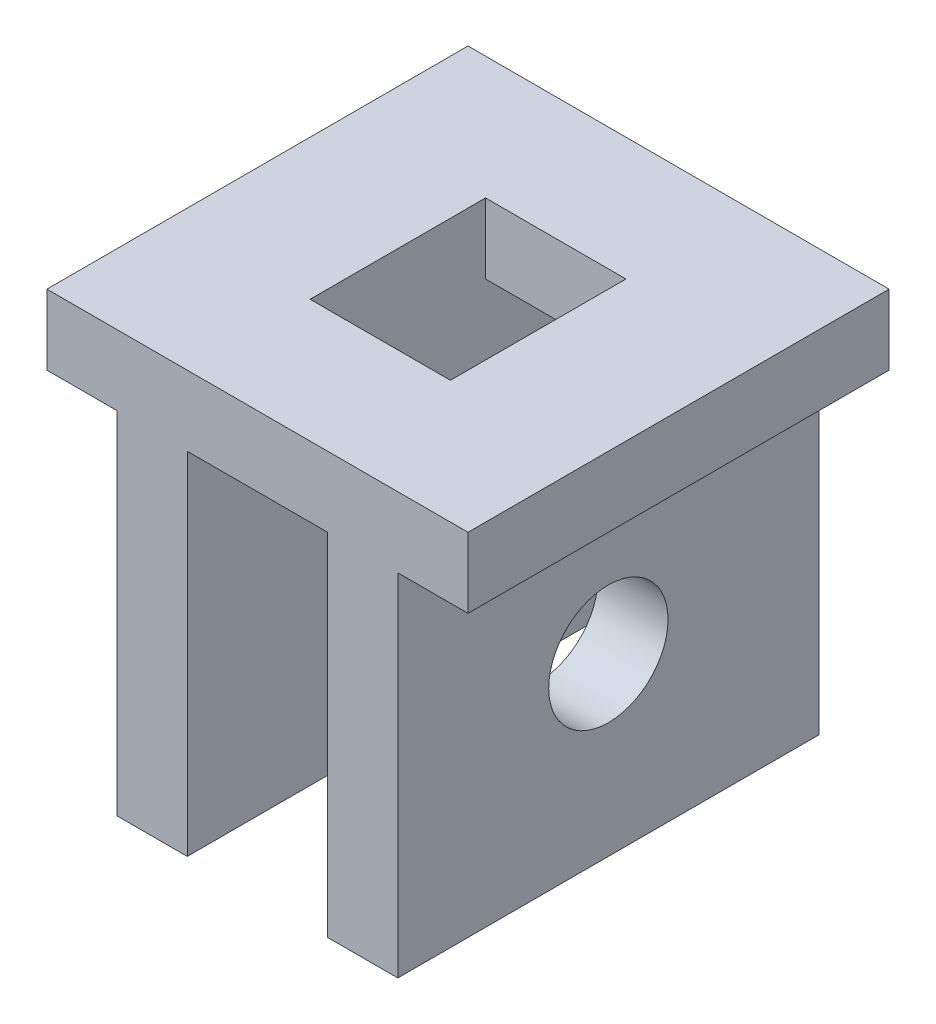
ISO-10303-21;
HEADER;
FILE_DESCRIPTION(('STEP AP214'),'2;1');
FILE_NAME('part.step','',(''),(''),'','','');
FILE_SCHEMA(('AUTOMOTIVE_DESIGN { 1 0 10303 214 1 1 1 1 }'));
ENDSEC;
DATA;
#1=APPLICATION_CONTEXT('core data for automotive mechanical design processes');
#2=APPLICATION_PROTOCOL_DEFINITION('international standard','automotive_design',2000,#1);
#3=PRODUCT_CONTEXT('',#1,'mechanical');
#4=PRODUCT('Part','Part','',(#3));
#5=PRODUCT_RELATED_PRODUCT_CATEGORY('part','',(#4));
#6=PRODUCT_DEFINITION_FORMATION('','',#4);
#7=PRODUCT_DEFINITION_CONTEXT('part definition',#1,'design');
#8=PRODUCT_DEFINITION('design','',#6,#7);
#9=PRODUCT_DEFINITION_SHAPE('','',#8);
#10=(LENGTH_UNIT() NAMED_UNIT(*) SI_UNIT(.MILLI.,.METRE.));
#11=(NAMED_UNIT(*) PLANE_ANGLE_UNIT() SI_UNIT($,.RADIAN.));
#12=(NAMED_UNIT(*) SI_UNIT($,.STERADIAN.) SOLID_ANGLE_UNIT());
#13=UNCERTAINTY_MEASURE_WITH_UNIT(LENGTH_MEASURE(1.E-05),#10,'distance_accuracy_value','');
#14=(GEOMETRIC_REPRESENTATION_CONTEXT(3) GLOBAL_UNCERTAINTY_ASSIGNED_CONTEXT((#13)) GLOBAL_UNIT_ASSIGNED_CONTEXT((#10,
#11,#12)) REPRESENTATION_CONTEXT('',''));
#15=CARTESIAN_POINT('',(0.,0.,0.));
#16=DIRECTION('',(0.,0.,1.));
#17=DIRECTION('',(1.,0.,0.));
#18=AXIS2_PLACEMENT_3D('',#15,#16,#17);
#19=CARTESIAN_POINT('',(0.,3.,0.));
#20=DIRECTION('',(0.,1.,0.));
#21=DIRECTION('',(0.,0.,1.));
#22=AXIS2_PLACEMENT_3D('',#19,#20,#21);
#23=PLANE('',#22);
#24=DIRECTION('',(0.,0.,1.));
#25=VECTOR('',#24,1.);
#26=CARTESIAN_POINT('',(-3.,3.,-3.));
#27=LINE('',#26,#25);
#28=CARTESIAN_POINT('',(-3.,3.,-3.));
#29=VERTEX_POINT('',#28);
#30=CARTESIAN_POINT('',(-3.,3.,0.));
#31=VERTEX_POINT('',#30);
#32=EDGE_CURVE('E290',#29,#31,#27,.T.);
#33=ORIENTED_EDGE('',*,*,#32,.T.);
#34=DIRECTION('',(1.,0.,0.));
#35=VECTOR('',#34,1.);
#36=CARTESIAN_POINT('',(-3.,3.,0.));
#37=LINE('',#36,#35);
#38=CARTESIAN_POINT('',(0.,3.,0.));
#39=VERTEX_POINT('',#38);
#40=EDGE_CURVE('E294',#31,#39,#37,.T.);
#41=ORIENTED_EDGE('',*,*,#40,.T.);
#42=DIRECTION('',(0.,0.,-1.));
#43=VECTOR('',#42,1.);
#44=CARTESIAN_POINT('',(0.,3.,-3.));
#45=LINE('',#44,#43);
#46=CARTESIAN_POINT('',(0.,3.,-3.));
#47=VERTEX_POINT('',#46);
#48=EDGE_CURVE('E298',#39,#47,#45,.T.);
#49=ORIENTED_EDGE('',*,*,#48,.T.);
#50=DIRECTION('',(-1.,0.,0.));
#51=VECTOR('',#50,1.);
#52=CARTESIAN_POINT('',(-3.,3.,-3.));
#53=LINE('',#52,#51);
#54=EDGE_CURVE('E301',#47,#29,#53,.T.);
#55=ORIENTED_EDGE('',*,*,#54,.T.);
#56=EDGE_LOOP('',(#33,#41,#49,#55));
#57=FACE_BOUND('',#56,.T.);
#58=DIRECTION('',(1.,0.,0.));
#59=VECTOR('',#58,1.);
#60=CARTESIAN_POINT('',(0.,3.,-2.125));
#61=LINE('',#60,#59);
#62=CARTESIAN_POINT('',(-2.,3.,-2.125));
#63=VERTEX_POINT('',#62);
#64=CARTESIAN_POINT('',(-1.,3.,-2.125));
#65=VERTEX_POINT('',#64);
#66=EDGE_CURVE('E171',#63,#65,#61,.T.);
#67=ORIENTED_EDGE('',*,*,#66,.T.);
#68=DIRECTION('',(0.,0.,1.));
#69=VECTOR('',#68,1.);
#70=CARTESIAN_POINT('',(-1.,3.,0.));
#71=LINE('',#70,#69);
#72=CARTESIAN_POINT('',(-1.,3.,-0.875));
#73=VERTEX_POINT('',#72);
#74=EDGE_CURVE('E59',#65,#73,#71,.T.);
#75=ORIENTED_EDGE('',*,*,#74,.T.);
#76=DIRECTION('',(1.,0.,0.));
#77=VECTOR('',#76,1.);
#78=CARTESIAN_POINT('',(0.,3.,-0.875));
#79=LINE('',#78,#77);
#80=CARTESIAN_POINT('',(-2.,3.,-0.875));
#81=VERTEX_POINT('',#80);
#82=EDGE_CURVE('E177',#81,#73,#79,.T.);
#83=ORIENTED_EDGE('',*,*,#82,.F.);
#84=DIRECTION('',(0.,0.,1.));
#85=VECTOR('',#84,1.);
#86=CARTESIAN_POINT('',(-2.,3.,0.));
#87=LINE('',#86,#85);
#88=EDGE_CURVE('E162',#63,#81,#87,.T.);
#89=ORIENTED_EDGE('',*,*,#88,.F.);
#90=EDGE_LOOP('',(#67,#75,#83,#89));
#91=FACE_BOUND('',#90,.T.);
#92=ADVANCED_FACE('F43',(#57,#91),#23,.T.);
#93=CARTESIAN_POINT('',(0.,2.5,0.));
#94=DIRECTION('',(0.,1.,0.));
#95=DIRECTION('',(0.,0.,1.));
#96=AXIS2_PLACEMENT_3D('',#93,#94,#95);
#97=PLANE('',#96);
#98=DIRECTION('',(1.,0.,0.));
#99=VECTOR('',#98,1.);
#100=CARTESIAN_POINT('',(0.,2.5,-2.125));
#101=LINE('',#100,#99);
#102=CARTESIAN_POINT('',(-2.,2.5,-2.125));
#103=VERTEX_POINT('',#102);
#104=CARTESIAN_POINT('',(-1.,2.5,-2.125));
#105=VERTEX_POINT('',#104);
#106=EDGE_CURVE('E52',#103,#105,#101,.T.);
#107=ORIENTED_EDGE('',*,*,#106,.F.);
#108=DIRECTION('',(0.,0.,-1.));
#109=VECTOR('',#108,1.);
#110=CARTESIAN_POINT('',(-2.,2.5,0.));
#111=LINE('',#110,#109);
#112=CARTESIAN_POINT('',(-2.,2.5,-3.));
#113=VERTEX_POINT('',#112);
#114=EDGE_CURVE('E165',#103,#113,#111,.T.);
#115=ORIENTED_EDGE('',*,*,#114,.T.);
#116=DIRECTION('',(1.,0.,0.));
#117=VECTOR('',#116,1.);
#118=CARTESIAN_POINT('',(-1.,2.5,-3.));
#119=LINE('',#118,#117);
#120=CARTESIAN_POINT('',(-1.,2.5,-3.));
#121=VERTEX_POINT('',#120);
#122=EDGE_CURVE('E266',#113,#121,#119,.T.);
#123=ORIENTED_EDGE('',*,*,#122,.T.);
#124=DIRECTION('',(0.,0.,1.));
#125=VECTOR('',#124,1.);
#126=CARTESIAN_POINT('',(-1.,2.5,0.));
#127=LINE('',#126,#125);
#128=EDGE_CURVE('E253',#121,#105,#127,.T.);
#129=ORIENTED_EDGE('',*,*,#128,.T.);
#130=EDGE_LOOP('',(#107,#115,#123,#129));
#131=FACE_BOUND('',#130,.T.);
#132=ADVANCED_FACE('F335',(#131),#97,.F.);
#133=CARTESIAN_POINT('',(0.,0.,0.));
#134=DIRECTION('',(0.,1.,0.));
#135=DIRECTION('',(0.,0.,1.));
#136=AXIS2_PLACEMENT_3D('',#133,#134,#135);
#137=PLANE('',#136);
#138=DIRECTION('',(-1.,0.,0.));
#139=VECTOR('',#138,1.);
#140=CARTESIAN_POINT('',(-3.,0.,-3.));
#141=LINE('',#140,#139);
#142=CARTESIAN_POINT('',(-0.500000000000001,0.,-3.));
#143=VERTEX_POINT('',#142);
#144=CARTESIAN_POINT('',(-1.,0.,-3.));
#145=VERTEX_POINT('',#144);
#146=EDGE_CURVE('E295',#143,#145,#141,.T.);
#147=ORIENTED_EDGE('',*,*,#146,.F.);
#148=DIRECTION('',(0.,0.,-1.));
#149=VECTOR('',#148,1.);
#150=CARTESIAN_POINT('',(-0.500000000000001,0.,0.));
#151=LINE('',#150,#149);
#152=CARTESIAN_POINT('',(-0.5,0.,0.));
#153=VERTEX_POINT('',#152);
#154=EDGE_CURVE('E214',#153,#143,#151,.T.);
#155=ORIENTED_EDGE('',*,*,#154,.F.);
#156=DIRECTION('',(1.,0.,0.));
#157=VECTOR('',#156,1.);
#158=CARTESIAN_POINT('',(-3.,0.,0.));
#159=LINE('',#158,#157);
#160=CARTESIAN_POINT('',(-1.,0.,0.));
#161=VERTEX_POINT('',#160);
#162=EDGE_CURVE('E279',#161,#153,#159,.T.);
#163=ORIENTED_EDGE('',*,*,#162,.F.);
#164=DIRECTION('',(0.,0.,1.));
#165=VECTOR('',#164,1.);
#166=CARTESIAN_POINT('',(-1.,0.,0.));
#167=LINE('',#166,#165);
#168=EDGE_CURVE('E217',#145,#161,#167,.T.);
#169=ORIENTED_EDGE('',*,*,#168,.F.);
#170=EDGE_LOOP('',(#147,#155,#163,#169));
#171=FACE_BOUND('',#170,.T.);
#172=ADVANCED_FACE('F346',(#171),#137,.F.);
#173=CARTESIAN_POINT('',(-3.,3.,-3.));
#174=DIRECTION('',(1.,0.,0.));
#175=DIRECTION('',(0.,0.,-1.));
#176=AXIS2_PLACEMENT_3D('',#173,#174,#175);
#177=PLANE('',#176);
#178=DIRECTION('',(0.,-1.,0.));
#179=VECTOR('',#178,1.);
#180=CARTESIAN_POINT('',(-3.,3.,-3.));
#181=LINE('',#180,#179);
#182=CARTESIAN_POINT('',(-3.,2.5,-3.));
#183=VERTEX_POINT('',#182);
#184=EDGE_CURVE('E304',#29,#183,#181,.T.);
#185=ORIENTED_EDGE('',*,*,#184,.T.);
#186=DIRECTION('',(0.,0.,-1.));
#187=VECTOR('',#186,1.);
#188=CARTESIAN_POINT('',(-3.,2.5,0.));
#189=LINE('',#188,#187);
#190=CARTESIAN_POINT('',(-3.,2.5,0.));
#191=VERTEX_POINT('',#190);
#192=EDGE_CURVE('E244',#191,#183,#189,.T.);
#193=ORIENTED_EDGE('',*,*,#192,.F.);
#194=DIRECTION('',(0.,-1.,0.));
#195=VECTOR('',#194,1.);
#196=CARTESIAN_POINT('',(-3.,3.,0.));
#197=LINE('',#196,#195);
#198=EDGE_CURVE('E324',#31,#191,#197,.T.);
#199=ORIENTED_EDGE('',*,*,#198,.F.);
#200=ORIENTED_EDGE('',*,*,#32,.F.);
#201=EDGE_LOOP('',(#185,#193,#199,#200));
#202=FACE_BOUND('',#201,.T.);
#203=ADVANCED_FACE('F45',(#202),#177,.F.);
#204=CARTESIAN_POINT('',(-3.,3.,0.));
#205=DIRECTION('',(0.,0.,-1.));
#206=DIRECTION('',(-1.,0.,0.));
#207=AXIS2_PLACEMENT_3D('',#204,#205,#206);
#208=PLANE('',#207);
#209=DIRECTION('',(-1.,0.,0.));
#210=VECTOR('',#209,1.);
#211=CARTESIAN_POINT('',(-2.5,2.5,0.));
#212=LINE('',#211,#210);
#213=CARTESIAN_POINT('',(-2.5,2.5,0.));
#214=VERTEX_POINT('',#213);
#215=EDGE_CURVE('E247',#214,#191,#212,.T.);
#216=ORIENTED_EDGE('',*,*,#215,.F.);
#217=DIRECTION('',(0.,-1.,0.));
#218=VECTOR('',#217,1.);
#219=CARTESIAN_POINT('',(-2.5,2.5,0.));
#220=LINE('',#219,#218);
#221=CARTESIAN_POINT('',(-2.5,0.,0.));
#222=VERTEX_POINT('',#221);
#223=EDGE_CURVE('E231',#214,#222,#220,.T.);
#224=ORIENTED_EDGE('',*,*,#223,.T.);
#225=CARTESIAN_POINT('',(-2.,0.,0.));
#226=VERTEX_POINT('',#225);
#227=EDGE_CURVE('E308',#222,#226,#159,.T.);
#228=ORIENTED_EDGE('',*,*,#227,.T.);
#229=DIRECTION('',(0.,-1.,0.));
#230=VECTOR('',#229,1.);
#231=CARTESIAN_POINT('',(-2.,2.5,0.));
#232=LINE('',#231,#230);
#233=CARTESIAN_POINT('',(-2.,2.5,0.));
#234=VERTEX_POINT('',#233);
#235=EDGE_CURVE('E284',#234,#226,#232,.T.);
#236=ORIENTED_EDGE('',*,*,#235,.F.);
#237=DIRECTION('',(-1.,0.,0.));
#238=VECTOR('',#237,1.);
#239=CARTESIAN_POINT('',(-1.,2.5,0.));
#240=LINE('',#239,#238);
#241=CARTESIAN_POINT('',(-1.,2.5,0.));
#242=VERTEX_POINT('',#241);
#243=EDGE_CURVE('E257',#242,#234,#240,.T.);
#244=ORIENTED_EDGE('',*,*,#243,.F.);
#245=DIRECTION('',(0.,-1.,0.));
#246=VECTOR('',#245,1.);
#247=CARTESIAN_POINT('',(-1.,2.5,0.));
#248=LINE('',#247,#246);
#249=EDGE_CURVE('E270',#242,#161,#248,.T.);
#250=ORIENTED_EDGE('',*,*,#249,.T.);
#251=ORIENTED_EDGE('',*,*,#162,.T.);
#252=DIRECTION('',(0.,-1.,0.));
#253=VECTOR('',#252,1.);
#254=CARTESIAN_POINT('',(-0.500000000000001,2.5,0.));
#255=LINE('',#254,#253);
#256=CARTESIAN_POINT('',(-0.500000000000001,2.5,0.));
#257=VERTEX_POINT('',#256);
#258=EDGE_CURVE('E205',#257,#153,#255,.T.);
#259=ORIENTED_EDGE('',*,*,#258,.F.);
#260=DIRECTION('',(-1.,0.,0.));
#261=VECTOR('',#260,1.);
#262=CARTESIAN_POINT('',(0.,2.5,0.));
#263=LINE('',#262,#261);
#264=CARTESIAN_POINT('',(0.,2.5,0.));
#265=VERTEX_POINT('',#264);
#266=EDGE_CURVE('E225',#265,#257,#263,.T.);
#267=ORIENTED_EDGE('',*,*,#266,.F.);
#268=DIRECTION('',(0.,-1.,0.));
#269=VECTOR('',#268,1.);
#270=CARTESIAN_POINT('',(0.,3.,0.));
#271=LINE('',#270,#269);
#272=EDGE_CURVE('E320',#39,#265,#271,.T.);
#273=ORIENTED_EDGE('',*,*,#272,.F.);
#274=ORIENTED_EDGE('',*,*,#40,.F.);
#275=ORIENTED_EDGE('',*,*,#198,.T.);
#276=EDGE_LOOP('',(#216,#224,#228,#236,#244,#250,#251,#259,#267,#273,#274,#275));
#277=FACE_BOUND('',#276,.T.);
#278=ADVANCED_FACE('F351',(#277),#208,.F.);
#279=CARTESIAN_POINT('',(0.,3.,-3.));
#280=DIRECTION('',(-1.,0.,0.));
#281=DIRECTION('',(0.,0.,1.));
#282=AXIS2_PLACEMENT_3D('',#279,#280,#281);
#283=PLANE('',#282);
#284=ORIENTED_EDGE('',*,*,#272,.T.);
#285=DIRECTION('',(0.,0.,1.));
#286=VECTOR('',#285,1.);
#287=CARTESIAN_POINT('',(0.,2.5,0.));
#288=LINE('',#287,#286);
#289=CARTESIAN_POINT('',(0.,2.5,-3.));
#290=VERTEX_POINT('',#289);
#291=EDGE_CURVE('E218',#290,#265,#288,.T.);
#292=ORIENTED_EDGE('',*,*,#291,.F.);
#293=DIRECTION('',(0.,-1.,0.));
#294=VECTOR('',#293,1.);
#295=CARTESIAN_POINT('',(0.,3.,-3.));
#296=LINE('',#295,#294);
#297=EDGE_CURVE('E316',#47,#290,#296,.T.);
#298=ORIENTED_EDGE('',*,*,#297,.F.);
#299=ORIENTED_EDGE('',*,*,#48,.F.);
#300=EDGE_LOOP('',(#284,#292,#298,#299));
#301=FACE_BOUND('',#300,.T.);
#302=ADVANCED_FACE('F386',(#301),#283,.F.);
#303=CARTESIAN_POINT('',(-3.,3.,-3.));
#304=DIRECTION('',(0.,0.,1.));
#305=DIRECTION('',(1.,0.,0.));
#306=AXIS2_PLACEMENT_3D('',#303,#304,#305);
#307=PLANE('',#306);
#308=CARTESIAN_POINT('',(-2.,0.,-3.));
#309=VERTEX_POINT('',#308);
#310=CARTESIAN_POINT('',(-2.5,0.,-3.));
#311=VERTEX_POINT('',#310);
#312=EDGE_CURVE('E309',#309,#311,#141,.T.);
#313=ORIENTED_EDGE('',*,*,#312,.T.);
#314=DIRECTION('',(0.,-1.,0.));
#315=VECTOR('',#314,1.);
#316=CARTESIAN_POINT('',(-2.5,2.5,-3.));
#317=LINE('',#316,#315);
#318=CARTESIAN_POINT('',(-2.5,2.5,-3.));
#319=VERTEX_POINT('',#318);
#320=EDGE_CURVE('E204',#319,#311,#317,.T.);
#321=ORIENTED_EDGE('',*,*,#320,.F.);
#322=DIRECTION('',(1.,0.,0.));
#323=VECTOR('',#322,1.);
#324=CARTESIAN_POINT('',(-2.5,2.5,-3.));
#325=LINE('',#324,#323);
#326=EDGE_CURVE('E235',#183,#319,#325,.T.);
#327=ORIENTED_EDGE('',*,*,#326,.F.);
#328=ORIENTED_EDGE('',*,*,#184,.F.);
#329=ORIENTED_EDGE('',*,*,#54,.F.);
#330=ORIENTED_EDGE('',*,*,#297,.T.);
#331=DIRECTION('',(1.,0.,0.));
#332=VECTOR('',#331,1.);
#333=CARTESIAN_POINT('',(0.,2.5,-3.));
#334=LINE('',#333,#332);
#335=CARTESIAN_POINT('',(-0.500000000000001,2.5,-3.));
#336=VERTEX_POINT('',#335);
#337=EDGE_CURVE('E208',#336,#290,#334,.T.);
#338=ORIENTED_EDGE('',*,*,#337,.F.);
#339=DIRECTION('',(0.,-1.,0.));
#340=VECTOR('',#339,1.);
#341=CARTESIAN_POINT('',(-0.500000000000001,2.5,-3.));
#342=LINE('',#341,#340);
#343=EDGE_CURVE('E209',#336,#143,#342,.T.);
#344=ORIENTED_EDGE('',*,*,#343,.T.);
#345=ORIENTED_EDGE('',*,*,#146,.T.);
#346=DIRECTION('',(0.,-1.,0.));
#347=VECTOR('',#346,1.);
#348=CARTESIAN_POINT('',(-1.,2.5,-3.));
#349=LINE('',#348,#347);
#350=EDGE_CURVE('E276',#121,#145,#349,.T.);
#351=ORIENTED_EDGE('',*,*,#350,.F.);
#352=ORIENTED_EDGE('',*,*,#122,.F.);
#353=DIRECTION('',(0.,-1.,0.));
#354=VECTOR('',#353,1.);
#355=CARTESIAN_POINT('',(-2.,2.5,-3.));
#356=LINE('',#355,#354);
#357=EDGE_CURVE('E280',#113,#309,#356,.T.);
#358=ORIENTED_EDGE('',*,*,#357,.T.);
#359=EDGE_LOOP('',(#313,#321,#327,#328,#329,#330,#338,#344,#345,#351,#352,#358));
#360=FACE_BOUND('',#359,.T.);
#361=ADVANCED_FACE('F340',(#360),#307,.F.);
#362=ORIENTED_EDGE('',*,*,#227,.F.);
#363=DIRECTION('',(0.,0.,1.));
#364=VECTOR('',#363,1.);
#365=CARTESIAN_POINT('',(-2.5,0.,0.));
#366=LINE('',#365,#364);
#367=EDGE_CURVE('E213',#311,#222,#366,.T.);
#368=ORIENTED_EDGE('',*,*,#367,.F.);
#369=ORIENTED_EDGE('',*,*,#312,.F.);
#370=DIRECTION('',(0.,0.,-1.));
#371=VECTOR('',#370,1.);
#372=CARTESIAN_POINT('',(-2.,0.,0.));
#373=LINE('',#372,#371);
#374=EDGE_CURVE('E273',#226,#309,#373,.T.);
#375=ORIENTED_EDGE('',*,*,#374,.F.);
#376=EDGE_LOOP('',(#362,#368,#369,#375));
#377=FACE_BOUND('',#376,.T.);
#378=ADVANCED_FACE('F365',(#377),#137,.F.);
#379=CARTESIAN_POINT('',(-1.,2.5,0.));
#380=DIRECTION('',(1.,0.,0.));
#381=DIRECTION('',(0.,0.,-1.));
#382=AXIS2_PLACEMENT_3D('',#379,#380,#381);
#383=PLANE('',#382);
#384=CARTESIAN_POINT('',(-1.,2.5,-0.875));
#385=VERTEX_POINT('',#384);
#386=EDGE_CURVE('E258',#385,#242,#127,.T.);
#387=ORIENTED_EDGE('',*,*,#386,.F.);
#388=DIRECTION('',(0.,1.,0.));
#389=VECTOR('',#388,1.);
#390=CARTESIAN_POINT('',(-1.,0.,-0.875));
#391=LINE('',#390,#389);
#392=EDGE_CURVE('E184',#385,#73,#391,.T.);
#393=ORIENTED_EDGE('',*,*,#392,.T.);
#394=ORIENTED_EDGE('',*,*,#74,.F.);
#395=DIRECTION('',(0.,1.,0.));
#396=VECTOR('',#395,1.);
#397=CARTESIAN_POINT('',(-1.,0.,-2.125));
#398=LINE('',#397,#396);
#399=EDGE_CURVE('E168',#105,#65,#398,.T.);
#400=ORIENTED_EDGE('',*,*,#399,.F.);
#401=ORIENTED_EDGE('',*,*,#128,.F.);
#402=ORIENTED_EDGE('',*,*,#350,.T.);
#403=ORIENTED_EDGE('',*,*,#168,.T.);
#404=ORIENTED_EDGE('',*,*,#249,.F.);
#405=EDGE_LOOP('',(#387,#393,#394,#400,#401,#402,#403,#404));
#406=FACE_BOUND('',#405,.T.);
#407=CARTESIAN_POINT('',(-1.,1.25,-1.5));
#408=DIRECTION('',(1.,0.,0.));
#409=DIRECTION('',(0.,0.,-1.));
#410=AXIS2_PLACEMENT_3D('',#407,#408,#409);
#411=CIRCLE('',#410,0.425);
#412=CARTESIAN_POINT('',(-1.,1.25,-1.925));
#413=VERTEX_POINT('',#412);
#414=EDGE_CURVE('E200',#413,#413,#411,.T.);
#415=ORIENTED_EDGE('',*,*,#414,.T.);
#416=EDGE_LOOP('',(#415));
#417=FACE_BOUND('',#416,.T.);
#418=ADVANCED_FACE('F333',(#406,#417),#383,.F.);
#419=CARTESIAN_POINT('',(-2.,2.5,0.));
#420=DIRECTION('',(-1.,0.,0.));
#421=DIRECTION('',(0.,0.,1.));
#422=AXIS2_PLACEMENT_3D('',#419,#420,#421);
#423=PLANE('',#422);
#424=ORIENTED_EDGE('',*,*,#374,.T.);
#425=ORIENTED_EDGE('',*,*,#357,.F.);
#426=ORIENTED_EDGE('',*,*,#114,.F.);
#427=DIRECTION('',(0.,1.,0.));
#428=VECTOR('',#427,1.);
#429=CARTESIAN_POINT('',(-2.,0.,-2.125));
#430=LINE('',#429,#428);
#431=EDGE_CURVE('E67',#103,#63,#430,.T.);
#432=ORIENTED_EDGE('',*,*,#431,.T.);
#433=ORIENTED_EDGE('',*,*,#88,.T.);
#434=DIRECTION('',(0.,1.,0.));
#435=VECTOR('',#434,1.);
#436=CARTESIAN_POINT('',(-2.,0.,-0.875));
#437=LINE('',#436,#435);
#438=CARTESIAN_POINT('',(-2.,2.5,-0.875));
#439=VERTEX_POINT('',#438);
#440=EDGE_CURVE('E167',#439,#81,#437,.T.);
#441=ORIENTED_EDGE('',*,*,#440,.F.);
#442=EDGE_CURVE('E262',#234,#439,#111,.T.);
#443=ORIENTED_EDGE('',*,*,#442,.F.);
#444=ORIENTED_EDGE('',*,*,#235,.T.);
#445=EDGE_LOOP('',(#424,#425,#426,#432,#433,#441,#443,#444));
#446=FACE_BOUND('',#445,.T.);
#447=CARTESIAN_POINT('',(-2.,1.25,-1.5));
#448=DIRECTION('',(-1.,0.,0.));
#449=DIRECTION('',(0.,0.,1.));
#450=AXIS2_PLACEMENT_3D('',#447,#448,#449);
#451=CIRCLE('',#450,0.425);
#452=CARTESIAN_POINT('',(-2.,1.25,-1.075));
#453=VERTEX_POINT('',#452);
#454=EDGE_CURVE('E196',#453,#453,#451,.T.);
#455=ORIENTED_EDGE('',*,*,#454,.T.);
#456=EDGE_LOOP('',(#455));
#457=FACE_BOUND('',#456,.T.);
#458=ADVANCED_FACE('F158',(#446,#457),#423,.F.);
#459=ORIENTED_EDGE('',*,*,#442,.T.);
#460=DIRECTION('',(1.,0.,0.));
#461=VECTOR('',#460,1.);
#462=CARTESIAN_POINT('',(0.,2.5,-0.875));
#463=LINE('',#462,#461);
#464=EDGE_CURVE('E11',#439,#385,#463,.T.);
#465=ORIENTED_EDGE('',*,*,#464,.T.);
#466=ORIENTED_EDGE('',*,*,#386,.T.);
#467=ORIENTED_EDGE('',*,*,#243,.T.);
#468=EDGE_LOOP('',(#459,#465,#466,#467));
#469=FACE_BOUND('',#468,.T.);
#470=ADVANCED_FACE('F392',(#469),#97,.F.);
#471=CARTESIAN_POINT('',(-0.500000000000001,2.5,0.));
#472=DIRECTION('',(-1.,0.,0.));
#473=DIRECTION('',(0.,0.,1.));
#474=AXIS2_PLACEMENT_3D('',#471,#472,#473);
#475=PLANE('',#474);
#476=CARTESIAN_POINT('',(-0.5,1.25,-1.5));
#477=DIRECTION('',(-1.,0.,0.));
#478=DIRECTION('',(0.,0.,1.));
#479=AXIS2_PLACEMENT_3D('',#476,#477,#478);
#480=CIRCLE('',#479,0.425);
#481=CARTESIAN_POINT('',(-0.5,1.25,-1.075));
#482=VERTEX_POINT('',#481);
#483=EDGE_CURVE('E192',#482,#482,#480,.T.);
#484=ORIENTED_EDGE('',*,*,#483,.T.);
#485=EDGE_LOOP('',(#484));
#486=FACE_BOUND('',#485,.T.);
#487=ORIENTED_EDGE('',*,*,#154,.T.);
#488=ORIENTED_EDGE('',*,*,#343,.F.);
#489=DIRECTION('',(0.,0.,-1.));
#490=VECTOR('',#489,1.);
#491=CARTESIAN_POINT('',(-0.500000000000001,2.5,0.));
#492=LINE('',#491,#490);
#493=EDGE_CURVE('E221',#257,#336,#492,.T.);
#494=ORIENTED_EDGE('',*,*,#493,.F.);
#495=ORIENTED_EDGE('',*,*,#258,.T.);
#496=EDGE_LOOP('',(#487,#488,#494,#495));
#497=FACE_BOUND('',#496,.T.);
#498=ADVANCED_FACE('F390',(#486,#497),#475,.F.);
#499=CARTESIAN_POINT('',(0.,2.5,0.));
#500=DIRECTION('',(0.,1.,0.));
#501=DIRECTION('',(0.,0.,1.));
#502=AXIS2_PLACEMENT_3D('',#499,#500,#501);
#503=PLANE('',#502);
#504=ORIENTED_EDGE('',*,*,#291,.T.);
#505=ORIENTED_EDGE('',*,*,#266,.T.);
#506=ORIENTED_EDGE('',*,*,#493,.T.);
#507=ORIENTED_EDGE('',*,*,#337,.T.);
#508=EDGE_LOOP('',(#504,#505,#506,#507));
#509=FACE_BOUND('',#508,.T.);
#510=ADVANCED_FACE('F388',(#509),#503,.F.);
#511=CARTESIAN_POINT('',(-2.5,2.5,0.));
#512=DIRECTION('',(1.,0.,0.));
#513=DIRECTION('',(0.,0.,-1.));
#514=AXIS2_PLACEMENT_3D('',#511,#512,#513);
#515=PLANE('',#514);
#516=CARTESIAN_POINT('',(-2.5,1.25,-1.5));
#517=DIRECTION('',(1.,0.,0.));
#518=DIRECTION('',(0.,0.,-1.));
#519=AXIS2_PLACEMENT_3D('',#516,#517,#518);
#520=CIRCLE('',#519,0.425);
#521=CARTESIAN_POINT('',(-2.5,1.25,-1.925));
#522=VERTEX_POINT('',#521);
#523=EDGE_CURVE('E187',#522,#522,#520,.T.);
#524=ORIENTED_EDGE('',*,*,#523,.T.);
#525=EDGE_LOOP('',(#524));
#526=FACE_BOUND('',#525,.T.);
#527=ORIENTED_EDGE('',*,*,#367,.T.);
#528=ORIENTED_EDGE('',*,*,#223,.F.);
#529=DIRECTION('',(0.,0.,1.));
#530=VECTOR('',#529,1.);
#531=CARTESIAN_POINT('',(-2.5,2.5,0.));
#532=LINE('',#531,#530);
#533=EDGE_CURVE('E240',#319,#214,#532,.T.);
#534=ORIENTED_EDGE('',*,*,#533,.F.);
#535=ORIENTED_EDGE('',*,*,#320,.T.);
#536=EDGE_LOOP('',(#527,#528,#534,#535));
#537=FACE_BOUND('',#536,.T.);
#538=ADVANCED_FACE('F371',(#526,#537),#515,.F.);
#539=CARTESIAN_POINT('',(0.,2.5,0.));
#540=DIRECTION('',(0.,1.,0.));
#541=DIRECTION('',(0.,0.,1.));
#542=AXIS2_PLACEMENT_3D('',#539,#540,#541);
#543=PLANE('',#542);
#544=ORIENTED_EDGE('',*,*,#533,.T.);
#545=ORIENTED_EDGE('',*,*,#215,.T.);
#546=ORIENTED_EDGE('',*,*,#192,.T.);
#547=ORIENTED_EDGE('',*,*,#326,.T.);
#548=EDGE_LOOP('',(#544,#545,#546,#547));
#549=FACE_BOUND('',#548,.T.);
#550=ADVANCED_FACE('F373',(#549),#543,.F.);
#551=CARTESIAN_POINT('',(-3.,1.25,-1.5));
#552=DIRECTION('',(1.,0.,0.));
#553=DIRECTION('',(0.,0.,-1.));
#554=AXIS2_PLACEMENT_3D('',#551,#552,#553);
#555=CYLINDRICAL_SURFACE('',#554,0.425);
#556=ORIENTED_EDGE('',*,*,#523,.F.);
#557=EDGE_LOOP('',(#556));
#558=FACE_BOUND('',#557,.T.);
#559=ORIENTED_EDGE('',*,*,#454,.F.);
#560=EDGE_LOOP('',(#559));
#561=FACE_BOUND('',#560,.T.);
#562=ADVANCED_FACE('F446',(#558,#561),#555,.F.);
#563=ORIENTED_EDGE('',*,*,#483,.F.);
#564=EDGE_LOOP('',(#563));
#565=FACE_BOUND('',#564,.T.);
#566=ORIENTED_EDGE('',*,*,#414,.F.);
#567=EDGE_LOOP('',(#566));
#568=FACE_BOUND('',#567,.T.);
#569=ADVANCED_FACE('F440',(#565,#568),#555,.F.);
#570=CARTESIAN_POINT('',(0.,0.,-0.875));
#571=DIRECTION('',(0.,0.,1.));
#572=DIRECTION('',(1.,0.,0.));
#573=AXIS2_PLACEMENT_3D('',#570,#571,#572);
#574=PLANE('',#573);
#575=ORIENTED_EDGE('',*,*,#440,.T.);
#576=ORIENTED_EDGE('',*,*,#82,.T.);
#577=ORIENTED_EDGE('',*,*,#392,.F.);
#578=ORIENTED_EDGE('',*,*,#464,.F.);
#579=EDGE_LOOP('',(#575,#576,#577,#578));
#580=FACE_BOUND('',#579,.T.);
#581=ADVANCED_FACE('F445',(#580),#574,.F.);
#582=CARTESIAN_POINT('',(0.,0.,-2.125));
#583=DIRECTION('',(0.,0.,1.));
#584=DIRECTION('',(1.,0.,0.));
#585=AXIS2_PLACEMENT_3D('',#582,#583,#584);
#586=PLANE('',#585);
#587=ORIENTED_EDGE('',*,*,#106,.T.);
#588=ORIENTED_EDGE('',*,*,#399,.T.);
#589=ORIENTED_EDGE('',*,*,#66,.F.);
#590=ORIENTED_EDGE('',*,*,#431,.F.);
#591=EDGE_LOOP('',(#587,#588,#589,#590));
#592=FACE_BOUND('',#591,.T.);
#593=ADVANCED_FACE('F172',(#592),#586,.T.);
#594=CLOSED_SHELL('',(#92,#132,#172,#203,#278,#302,#361,#378,#418,#458,#470,#498,#510,#538,#550,
#562,#569,#581,#593));
#595=MANIFOLD_SOLID_BREP('B2',#594);
#596=ADVANCED_BREP_SHAPE_REPRESENTATION('',(#18,#595),#14);
#597=SHAPE_DEFINITION_REPRESENTATION(#9,#596);
ENDSEC;
END-ISO-10303-21;
